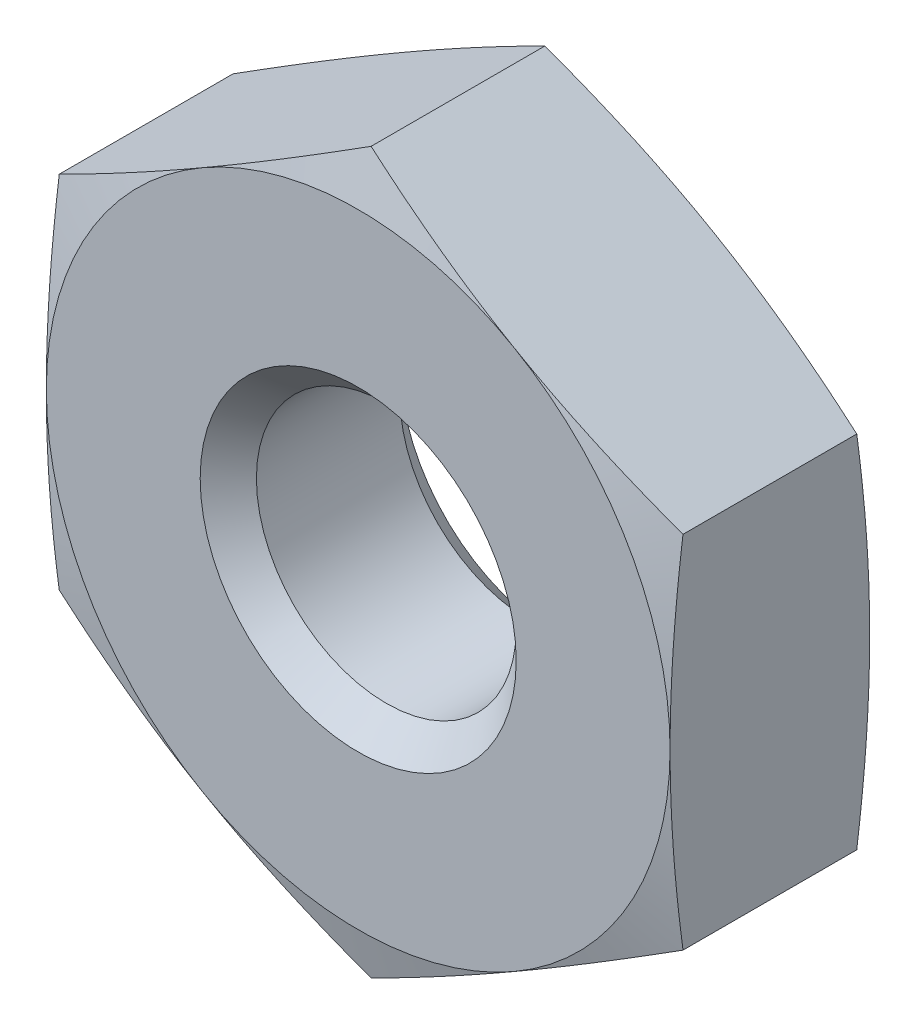
ISO-10303-21;
HEADER;
FILE_DESCRIPTION(('STEP AP214'),'2;1');
FILE_NAME('part.step','',(''),(''),'','','');
FILE_SCHEMA(('AUTOMOTIVE_DESIGN { 1 0 10303 214 1 1 1 1 }'));
ENDSEC;
DATA;
#1=APPLICATION_CONTEXT('core data for automotive mechanical design processes');
#2=APPLICATION_PROTOCOL_DEFINITION('international standard','automotive_design',2000,#1);
#3=PRODUCT_CONTEXT('',#1,'mechanical');
#4=PRODUCT('Part','Part','',(#3));
#5=PRODUCT_RELATED_PRODUCT_CATEGORY('part','',(#4));
#6=PRODUCT_DEFINITION_FORMATION('','',#4);
#7=PRODUCT_DEFINITION_CONTEXT('part definition',#1,'design');
#8=PRODUCT_DEFINITION('design','',#6,#7);
#9=PRODUCT_DEFINITION_SHAPE('','',#8);
#10=(LENGTH_UNIT() NAMED_UNIT(*) SI_UNIT(.MILLI.,.METRE.));
#11=(NAMED_UNIT(*) PLANE_ANGLE_UNIT() SI_UNIT($,.RADIAN.));
#12=(NAMED_UNIT(*) SI_UNIT($,.STERADIAN.) SOLID_ANGLE_UNIT());
#13=UNCERTAINTY_MEASURE_WITH_UNIT(LENGTH_MEASURE(1.E-05),#10,'distance_accuracy_value','');
#14=(GEOMETRIC_REPRESENTATION_CONTEXT(3) GLOBAL_UNCERTAINTY_ASSIGNED_CONTEXT((#13)) GLOBAL_UNIT_ASSIGNED_CONTEXT((#10,
#11,#12)) REPRESENTATION_CONTEXT('',''));
#15=CARTESIAN_POINT('',(0.,0.,0.));
#16=DIRECTION('',(0.,0.,1.));
#17=DIRECTION('',(1.,0.,0.));
#18=AXIS2_PLACEMENT_3D('',#15,#16,#17);
#19=CARTESIAN_POINT('',(0.,0.,0.));
#20=DIRECTION('',(0.,0.,-1.));
#21=DIRECTION('',(-1.,0.,0.));
#22=AXIS2_PLACEMENT_3D('',#19,#20,#21);
#23=PLANE('',#22);
#24=CARTESIAN_POINT('',(0.,0.,0.));
#25=DIRECTION('',(0.,0.,1.));
#26=DIRECTION('',(1.,0.,0.));
#27=AXIS2_PLACEMENT_3D('',#24,#25,#26);
#28=CIRCLE('',#27,2.41299999999001);
#29=CARTESIAN_POINT('',(2.41299999999001,0.,0.));
#30=VERTEX_POINT('',#29);
#31=EDGE_CURVE('E20',#30,#30,#28,.F.);
#32=ORIENTED_EDGE('',*,*,#31,.T.);
#33=EDGE_LOOP('',(#32));
#34=FACE_BOUND('',#33,.T.);
#35=CARTESIAN_POINT('',(0.,0.,0.));
#36=DIRECTION('',(0.,0.,-1.));
#37=DIRECTION('',(0.,1.,0.));
#38=AXIS2_PLACEMENT_3D('',#35,#36,#37);
#39=CIRCLE('',#38,4.7624999999698);
#40=CARTESIAN_POINT('',(-4.7624999999849,0.,-4.04533606351852E-12));
#41=VERTEX_POINT('',#40);
#42=CARTESIAN_POINT('',(-2.38124999999246,4.12444598551032,-4.04657973044043E-12));
#43=VERTEX_POINT('',#42);
#44=EDGE_CURVE('E130',#41,#43,#39,.T.);
#45=ORIENTED_EDGE('',*,*,#44,.F.);
#46=CARTESIAN_POINT('',(0.,0.,0.));
#47=DIRECTION('',(0.,0.,-1.));
#48=DIRECTION('',(0.,1.,0.));
#49=AXIS2_PLACEMENT_3D('',#46,#47,#48);
#50=CIRCLE('',#49,4.7624999999698);
#51=CARTESIAN_POINT('',(-2.38124999999245,-4.12444598551032,-4.04580046008107E-12));
#52=VERTEX_POINT('',#51);
#53=EDGE_CURVE('E128',#52,#41,#50,.T.);
#54=ORIENTED_EDGE('',*,*,#53,.F.);
#55=CARTESIAN_POINT('',(0.,0.,0.));
#56=DIRECTION('',(0.,0.,-1.));
#57=DIRECTION('',(0.,1.,0.));
#58=AXIS2_PLACEMENT_3D('',#55,#56,#57);
#59=CIRCLE('',#58,4.7624999999698);
#60=CARTESIAN_POINT('',(2.38124999999246,-4.12444598551031,-4.04656131367248E-12));
#61=VERTEX_POINT('',#60);
#62=EDGE_CURVE('E110',#61,#52,#59,.T.);
#63=ORIENTED_EDGE('',*,*,#62,.F.);
#64=CARTESIAN_POINT('',(0.,0.,0.));
#65=DIRECTION('',(0.,0.,-1.));
#66=DIRECTION('',(0.,1.,0.));
#67=AXIS2_PLACEMENT_3D('',#64,#65,#66);
#68=CIRCLE('',#67,4.7624999999698);
#69=CARTESIAN_POINT('',(4.7624999999849,0.,-4.04533558540813E-12));
#70=VERTEX_POINT('',#69);
#71=EDGE_CURVE('E103',#70,#61,#68,.T.);
#72=ORIENTED_EDGE('',*,*,#71,.F.);
#73=CARTESIAN_POINT('',(0.,0.,0.));
#74=DIRECTION('',(0.,0.,-1.));
#75=DIRECTION('',(0.,1.,0.));
#76=AXIS2_PLACEMENT_3D('',#73,#74,#75);
#77=CIRCLE('',#76,4.7624999999698);
#78=CARTESIAN_POINT('',(2.38124999999245,4.12444598551031,-4.04582372559714E-12));
#79=VERTEX_POINT('',#78);
#80=EDGE_CURVE('E425',#79,#70,#77,.T.);
#81=ORIENTED_EDGE('',*,*,#80,.F.);
#82=CARTESIAN_POINT('',(0.,0.,0.));
#83=DIRECTION('',(0.,0.,-1.));
#84=DIRECTION('',(0.,1.,0.));
#85=AXIS2_PLACEMENT_3D('',#82,#83,#84);
#86=CIRCLE('',#85,4.7624999999698);
#87=EDGE_CURVE('E135',#43,#79,#86,.T.);
#88=ORIENTED_EDGE('',*,*,#87,.F.);
#89=EDGE_LOOP('',(#45,#54,#63,#72,#81,#88));
#90=FACE_BOUND('',#89,.T.);
#91=ADVANCED_FACE('F17',(#34,#90),#23,.F.);
#92=CARTESIAN_POINT('',(0.,0.,0.));
#93=DIRECTION('',(0.,0.,1.));
#94=DIRECTION('',(1.,0.,0.));
#95=AXIS2_PLACEMENT_3D('',#92,#93,#94);
#96=CONICAL_SURFACE('',#95,2.41299999999001,0.785398163397448);
#97=ORIENTED_EDGE('',*,*,#31,.F.);
#98=EDGE_LOOP('',(#97));
#99=FACE_BOUND('',#98,.T.);
#100=CARTESIAN_POINT('',(0.,0.,-0.42926));
#101=DIRECTION('',(0.,0.,1.));
#102=DIRECTION('',(1.,0.,0.));
#103=AXIS2_PLACEMENT_3D('',#100,#101,#102);
#104=CIRCLE('',#103,1.98374);
#105=CARTESIAN_POINT('',(1.98374,0.,-0.42926));
#106=VERTEX_POINT('',#105);
#107=EDGE_CURVE('E125',#106,#106,#104,.F.);
#108=ORIENTED_EDGE('',*,*,#107,.T.);
#109=EDGE_LOOP('',(#108));
#110=FACE_BOUND('',#109,.T.);
#111=ADVANCED_FACE('F397',(#99,#110),#96,.F.);
#112=CARTESIAN_POINT('',(0.,0.,-0.198599086729701));
#113=DIRECTION('',(0.,0.,-1.));
#114=DIRECTION('',(0.,1.,0.));
#115=AXIS2_PLACEMENT_3D('',#112,#113,#114);
#116=CONICAL_SURFACE('',#115,5.50368188197581,1.30899693899372);
#117=ORIENTED_EDGE('',*,*,#62,.T.);
#118=CARTESIAN_POINT('',(-1.10100781708096E-12,-5.49926131403055,-0.197414599118673));
#119=CARTESIAN_POINT('',(-0.197405840343341,-5.38528899896936,-0.166865512952063));
#120=CARTESIAN_POINT('',(-0.395166009137093,-5.2711121122813,-0.139125457541238));
#121=CARTESIAN_POINT('',(-0.791077990089859,-5.04253222350282,-0.0904103419889045));
#122=CARTESIAN_POINT('',(-0.989229100594217,-4.92812962651291,-0.0694276203508561));
#123=CARTESIAN_POINT('',(-1.38610237940164,-4.69899473215927,-0.0352954826427711));
#124=CARTESIAN_POINT('',(-1.58482467133357,-4.58426236341839,-0.022147914684576));
#125=CARTESIAN_POINT('',(-1.88322873930389,-4.41197869444845,-0.0089070268822042));
#126=CARTESIAN_POINT('',(-1.98280832106101,-4.35448639611518,-0.00557342497592602));
#127=CARTESIAN_POINT('',(-2.18200766587997,-4.23947860076156,-0.00111726033218135));
#128=CARTESIAN_POINT('',(-2.28162743013149,-4.18196310305434,5.23126526352427E-06));
#129=CARTESIAN_POINT('',(-2.38125,-4.12444598552339,-8.09156365887653E-12));
#130=B_SPLINE_CURVE_WITH_KNOTS('',3,(#118,#119,#120,#121,#122,#123,#124,#125,#126,#127,#128,
#129),.UNSPECIFIED.,.F.,.F.,(4,2,2,2,2,4),(0.,0.68997774530214,1.37917041365534,
2.06852558060972,2.41360556986701,2.75869666150886),.UNSPECIFIED.);
#131=CARTESIAN_POINT('',(0.,-5.49926131403055,-0.197414599118673));
#132=VERTEX_POINT('',#131);
#133=EDGE_CURVE('E113',#132,#52,#130,.T.);
#134=ORIENTED_EDGE('',*,*,#133,.F.);
#135=CARTESIAN_POINT('',(2.38125000000001,-4.1244459855234,-8.09310346985567E-12));
#136=CARTESIAN_POINT('',(2.2816274301315,-4.18196310305434,5.23126526195123E-06));
#137=CARTESIAN_POINT('',(2.18200766587997,-4.23947860076157,-0.00111726033218282));
#138=CARTESIAN_POINT('',(1.98280832106102,-4.35448639611519,-0.00557342497592722));
#139=CARTESIAN_POINT('',(1.8832287393039,-4.41197869444845,-0.00890702688220526));
#140=CARTESIAN_POINT('',(1.58482467133357,-4.5842623634184,-0.0221479146845768));
#141=CARTESIAN_POINT('',(1.38610237940164,-4.69899473215928,-0.0352954826427721));
#142=CARTESIAN_POINT('',(0.989229100594223,-4.92812962651291,-0.0694276203508573));
#143=CARTESIAN_POINT('',(0.791077990089865,-5.04253222350282,-0.0904103419889056));
#144=CARTESIAN_POINT('',(0.395166009137099,-5.2711121122813,-0.139125457541239));
#145=CARTESIAN_POINT('',(0.197405840343347,-5.38528899896936,-0.166865512952064));
#146=CARTESIAN_POINT('',(1.10691644819718E-12,-5.49926131403056,-0.197414599118673));
#147=B_SPLINE_CURVE_WITH_KNOTS('',3,(#135,#136,#137,#138,#139,#140,#141,#142,#143,#144,#145,
#146),.UNSPECIFIED.,.F.,.F.,(4,2,2,2,2,4),(0.,0.345091091641847,0.690171080899136,
1.37952624785352,2.06871891620672,2.75869666150886),.UNSPECIFIED.);
#148=EDGE_CURVE('E115',#61,#132,#147,.T.);
#149=ORIENTED_EDGE('',*,*,#148,.F.);
#150=EDGE_LOOP('',(#117,#134,#149));
#151=FACE_BOUND('',#150,.T.);
#152=ADVANCED_FACE('F112',(#151),#116,.T.);
#153=CARTESIAN_POINT('',(0.,0.,-0.198599086729701));
#154=DIRECTION('',(0.,0.,-1.));
#155=DIRECTION('',(0.,1.,0.));
#156=AXIS2_PLACEMENT_3D('',#153,#154,#155);
#157=CONICAL_SURFACE('',#156,5.50368188197581,1.30899693899372);
#158=ORIENTED_EDGE('',*,*,#71,.T.);
#159=CARTESIAN_POINT('',(4.7624999999989,-2.74963065701624,-0.197414599118673));
#160=CARTESIAN_POINT('',(4.56509415965666,-2.86360297207744,-0.166865512952064));
#161=CARTESIAN_POINT('',(4.36733399086291,-2.97777985876549,-0.139125457541239));
#162=CARTESIAN_POINT('',(3.97142200991014,-3.20635974754397,-0.0904103419889058));
#163=CARTESIAN_POINT('',(3.77327089940579,-3.32076234453388,-0.0694276203508575));
#164=CARTESIAN_POINT('',(3.37639762059837,-3.54989723888751,-0.0352954826427724));
#165=CARTESIAN_POINT('',(3.17767532866644,-3.66462960762839,-0.0221479146845772));
#166=CARTESIAN_POINT('',(2.87927126069612,-3.83691327659834,-0.00890702688220558));
#167=CARTESIAN_POINT('',(2.77969167893899,-3.8944055749316,-0.00557342497592748));
#168=CARTESIAN_POINT('',(2.58049233412004,-4.00941337028522,-0.00111726033218291));
#169=CARTESIAN_POINT('',(2.48087256986852,-4.06692886799245,5.23126526196898E-06));
#170=CARTESIAN_POINT('',(2.38125000000001,-4.1244459855234,-8.09294901954408E-12));
#171=B_SPLINE_CURVE_WITH_KNOTS('',3,(#159,#160,#161,#162,#163,#164,#165,#166,#167,#168,#169,
#170),.UNSPECIFIED.,.F.,.F.,(4,2,2,2,2,4),(0.,0.689977745302137,1.37917041365533,
2.06852558060971,2.413605569867,2.75869666150884),.UNSPECIFIED.);
#172=CARTESIAN_POINT('',(4.76249999999945,-2.74963065701528,-0.197414599118673));
#173=VERTEX_POINT('',#172);
#174=EDGE_CURVE('E139',#173,#61,#171,.T.);
#175=ORIENTED_EDGE('',*,*,#174,.F.);
#176=CARTESIAN_POINT('',(4.7625,0.,-8.09065780609849E-12));
#177=CARTESIAN_POINT('',(4.7625,-0.115034235061893,5.23126526450705E-06));
#178=CARTESIAN_POINT('',(4.7625,-0.230065230476342,-0.00111726033218035));
#179=CARTESIAN_POINT('',(4.7625,-0.460080821183584,-0.00557342497592502));
#180=CARTESIAN_POINT('',(4.7625,-0.575065417850113,-0.00890702688220324));
#181=CARTESIAN_POINT('',(4.7625,-0.919632755790004,-0.0221479146845751));
#182=CARTESIAN_POINT('',(4.7625,-1.14909749327177,-0.0352954826427701));
#183=CARTESIAN_POINT('',(4.7625,-1.60736728197903,-0.0694276203508552));
#184=CARTESIAN_POINT('',(4.7625,-1.83617247595886,-0.0904103419889037));
#185=CARTESIAN_POINT('',(4.7625,-2.29333225351581,-0.139125457541237));
#186=CARTESIAN_POINT('',(4.7625,-2.52168602689193,-0.166865512952062));
#187=CARTESIAN_POINT('',(4.7625,-2.74963065701432,-0.197414599118672));
#188=B_SPLINE_CURVE_WITH_KNOTS('',3,(#176,#177,#178,#179,#180,#181,#182,#183,#184,#185,#186,
#187),.UNSPECIFIED.,.F.,.F.,(4,2,2,2,2,4),(0.,0.345091091641847,0.690171080899136,
1.37952624785352,2.06871891620672,2.75869666150886),.UNSPECIFIED.);
#189=EDGE_CURVE('E321',#70,#173,#188,.T.);
#190=ORIENTED_EDGE('',*,*,#189,.F.);
#191=EDGE_LOOP('',(#158,#175,#190));
#192=FACE_BOUND('',#191,.T.);
#193=ADVANCED_FACE('F389',(#192),#157,.T.);
#194=CARTESIAN_POINT('',(0.,0.,-0.198599086729701));
#195=DIRECTION('',(0.,0.,-1.));
#196=DIRECTION('',(0.,1.,0.));
#197=AXIS2_PLACEMENT_3D('',#194,#195,#196);
#198=CONICAL_SURFACE('',#197,5.50368188197581,1.30899693899372);
#199=ORIENTED_EDGE('',*,*,#80,.T.);
#200=CARTESIAN_POINT('',(4.7625,2.74963065701432,-0.197414599118672));
#201=CARTESIAN_POINT('',(4.7625,2.52168602689193,-0.166865512952062));
#202=CARTESIAN_POINT('',(4.7625,2.29333225351581,-0.139125457541237));
#203=CARTESIAN_POINT('',(4.7625,1.83617247595886,-0.0904103419889038));
#204=CARTESIAN_POINT('',(4.7625,1.60736728197903,-0.0694276203508553));
#205=CARTESIAN_POINT('',(4.7625,1.14909749327176,-0.0352954826427701));
#206=CARTESIAN_POINT('',(4.7625,0.919632755790003,-0.022147914684575));
#207=CARTESIAN_POINT('',(4.7625,0.575065417850113,-0.0089070268822032));
#208=CARTESIAN_POINT('',(4.7625,0.460080821183584,-0.005573424975925));
#209=CARTESIAN_POINT('',(4.7625,0.230065230476342,-0.00111726033218035));
#210=CARTESIAN_POINT('',(4.7625,0.115034235061893,5.23126526450129E-06));
#211=CARTESIAN_POINT('',(4.7625,0.,-8.09064406576194E-12));
#212=B_SPLINE_CURVE_WITH_KNOTS('',3,(#200,#201,#202,#203,#204,#205,#206,#207,#208,#209,#210,
#211),.UNSPECIFIED.,.F.,.F.,(4,2,2,2,2,4),(0.,0.68997774530214,1.37917041365534,
2.06852558060972,2.41360556986701,2.75869666150886),.UNSPECIFIED.);
#213=CARTESIAN_POINT('',(4.76249999999945,2.74963065701528,-0.197414599118672));
#214=VERTEX_POINT('',#213);
#215=EDGE_CURVE('E317',#214,#70,#212,.T.);
#216=ORIENTED_EDGE('',*,*,#215,.F.);
#217=CARTESIAN_POINT('',(2.38125,4.12444598552339,-8.09151740188484E-12));
#218=CARTESIAN_POINT('',(2.48087256986851,4.06692886799244,5.23126526366738E-06));
#219=CARTESIAN_POINT('',(2.58049233412004,4.00941337028522,-0.00111726033218119));
#220=CARTESIAN_POINT('',(2.77969167893899,3.8944055749316,-0.0055734249759259));
#221=CARTESIAN_POINT('',(2.87927126069611,3.83691327659834,-0.00890702688220413));
#222=CARTESIAN_POINT('',(3.17767532866643,3.66462960762839,-0.022147914684576));
#223=CARTESIAN_POINT('',(3.37639762059837,3.54989723888751,-0.0352954826427711));
#224=CARTESIAN_POINT('',(3.77327089940578,3.32076234453388,-0.0694276203508561));
#225=CARTESIAN_POINT('',(3.97142200991014,3.20635974754397,-0.0904103419889044));
#226=CARTESIAN_POINT('',(4.3673339908629,2.97777985876549,-0.139125457541237));
#227=CARTESIAN_POINT('',(4.56509415965665,2.86360297207743,-0.166865512952062));
#228=CARTESIAN_POINT('',(4.76249999999889,2.74963065701623,-0.197414599118672));
#229=B_SPLINE_CURVE_WITH_KNOTS('',3,(#217,#218,#219,#220,#221,#222,#223,#224,#225,#226,#227,
#228),.UNSPECIFIED.,.F.,.F.,(4,2,2,2,2,4),(0.,0.345091091641846,0.690171080899133,
1.37952624785351,2.06871891620671,2.75869666150884),.UNSPECIFIED.);
#230=EDGE_CURVE('E325',#79,#214,#229,.T.);
#231=ORIENTED_EDGE('',*,*,#230,.F.);
#232=EDGE_LOOP('',(#199,#216,#231));
#233=FACE_BOUND('',#232,.T.);
#234=ADVANCED_FACE('F392',(#233),#198,.T.);
#235=CARTESIAN_POINT('',(0.,0.,-0.198599086729701));
#236=DIRECTION('',(0.,0.,-1.));
#237=DIRECTION('',(0.,1.,0.));
#238=AXIS2_PLACEMENT_3D('',#235,#236,#237);
#239=CONICAL_SURFACE('',#238,5.50368188197581,1.30899693899372);
#240=CARTESIAN_POINT('',(-2.38125000000001,4.1244459855234,-8.09315141584367E-12));
#241=CARTESIAN_POINT('',(-2.2816274301315,4.18196310305434,5.23126526194159E-06));
#242=CARTESIAN_POINT('',(-2.18200766587997,4.23947860076157,-0.00111726033218282));
#243=CARTESIAN_POINT('',(-1.98280832106102,4.35448639611519,-0.00557342497592722));
#244=CARTESIAN_POINT('',(-1.8832287393039,4.41197869444845,-0.00890702688220527));
#245=CARTESIAN_POINT('',(-1.58482467133357,4.5842623634184,-0.0221479146845769));
#246=CARTESIAN_POINT('',(-1.38610237940164,4.69899473215928,-0.0352954826427721));
#247=CARTESIAN_POINT('',(-0.989229100594223,4.92812962651291,-0.0694276203508573));
#248=CARTESIAN_POINT('',(-0.791077990089865,5.04253222350282,-0.0904103419889056));
#249=CARTESIAN_POINT('',(-0.395166009137099,5.2711121122813,-0.139125457541239));
#250=CARTESIAN_POINT('',(-0.197405840343347,5.38528899896936,-0.166865512952064));
#251=CARTESIAN_POINT('',(-1.10691644819718E-12,5.49926131403056,-0.197414599118673));
#252=B_SPLINE_CURVE_WITH_KNOTS('',3,(#240,#241,#242,#243,#244,#245,#246,#247,#248,#249,#250,
#251),.UNSPECIFIED.,.F.,.F.,(4,2,2,2,2,4),(0.,0.345091091641847,0.690171080899136,
1.37952624785352,2.06871891620672,2.75869666150886),.UNSPECIFIED.);
#253=CARTESIAN_POINT('',(0.,5.49926131403055,-0.197414599118673));
#254=VERTEX_POINT('',#253);
#255=EDGE_CURVE('E183',#43,#254,#252,.T.);
#256=ORIENTED_EDGE('',*,*,#255,.F.);
#257=ORIENTED_EDGE('',*,*,#87,.T.);
#258=CARTESIAN_POINT('',(1.1017532977768E-12,5.49926131403055,-0.197414599118673));
#259=CARTESIAN_POINT('',(0.197405840343342,5.38528899896935,-0.166865512952063));
#260=CARTESIAN_POINT('',(0.395166009137094,5.2711121122813,-0.139125457541237));
#261=CARTESIAN_POINT('',(0.79107799008986,5.04253222350282,-0.0904103419889044));
#262=CARTESIAN_POINT('',(0.989229100594218,4.92812962651291,-0.0694276203508561));
#263=CARTESIAN_POINT('',(1.38610237940164,4.69899473215927,-0.035295482642771));
#264=CARTESIAN_POINT('',(1.58482467133357,4.58426236341839,-0.0221479146845757));
#265=CARTESIAN_POINT('',(1.88322873930389,4.41197869444845,-0.00890702688220403));
#266=CARTESIAN_POINT('',(1.98280832106101,4.35448639611518,-0.00557342497592598));
#267=CARTESIAN_POINT('',(2.18200766587997,4.23947860076156,-0.0011172603321815));
#268=CARTESIAN_POINT('',(2.28162743013149,4.18196310305434,5.23126526332879E-06));
#269=CARTESIAN_POINT('',(2.38125,4.12444598552339,-8.09160046136907E-12));
#270=B_SPLINE_CURVE_WITH_KNOTS('',3,(#258,#259,#260,#261,#262,#263,#264,#265,#266,#267,#268,
#269),.UNSPECIFIED.,.F.,.F.,(4,2,2,2,2,4),(0.,0.68997774530214,1.37917041365534,
2.06852558060972,2.41360556986701,2.75869666150886),.UNSPECIFIED.);
#271=EDGE_CURVE('E320',#254,#79,#270,.T.);
#272=ORIENTED_EDGE('',*,*,#271,.F.);
#273=EDGE_LOOP('',(#256,#257,#272));
#274=FACE_BOUND('',#273,.T.);
#275=ADVANCED_FACE('F165',(#274),#239,.T.);
#276=CARTESIAN_POINT('',(0.,0.,-0.198599086729701));
#277=DIRECTION('',(0.,0.,-1.));
#278=DIRECTION('',(0.,1.,0.));
#279=AXIS2_PLACEMENT_3D('',#276,#277,#278);
#280=CONICAL_SURFACE('',#279,5.50368188197581,1.30899693899372);
#281=CARTESIAN_POINT('',(-2.38125,-4.12444598552339,-8.09163584341431E-12));
#282=CARTESIAN_POINT('',(-2.48087256986851,-4.06692886799244,5.23126526345237E-06));
#283=CARTESIAN_POINT('',(-2.58049233412004,-4.00941337028522,-0.00111726033218138));
#284=CARTESIAN_POINT('',(-2.77969167893899,-3.8944055749316,-0.00557342497592596));
#285=CARTESIAN_POINT('',(-2.87927126069611,-3.83691327659834,-0.0089070268822041));
#286=CARTESIAN_POINT('',(-3.17767532866643,-3.66462960762839,-0.0221479146845759));
#287=CARTESIAN_POINT('',(-3.37639762059837,-3.54989723888751,-0.0352954826427711));
#288=CARTESIAN_POINT('',(-3.77327089940578,-3.32076234453388,-0.0694276203508561));
#289=CARTESIAN_POINT('',(-3.97142200991014,-3.20635974754397,-0.0904103419889043));
#290=CARTESIAN_POINT('',(-4.3673339908629,-2.97777985876549,-0.139125457541237));
#291=CARTESIAN_POINT('',(-4.56509415965665,-2.86360297207743,-0.166865512952062));
#292=CARTESIAN_POINT('',(-4.76249999999889,-2.74963065701623,-0.197414599118672));
#293=B_SPLINE_CURVE_WITH_KNOTS('',3,(#281,#282,#283,#284,#285,#286,#287,#288,#289,#290,#291,
#292),.UNSPECIFIED.,.F.,.F.,(4,2,2,2,2,4),(0.,0.345091091641846,0.690171080899134,
1.37952624785351,2.06871891620671,2.75869666150885),.UNSPECIFIED.);
#294=CARTESIAN_POINT('',(-4.76249999999945,-2.74963065701592,-0.197414599118757));
#295=VERTEX_POINT('',#294);
#296=EDGE_CURVE('E122',#52,#295,#293,.T.);
#297=ORIENTED_EDGE('',*,*,#296,.F.);
#298=ORIENTED_EDGE('',*,*,#53,.T.);
#299=CARTESIAN_POINT('',(-4.7625,-2.74963065701432,-0.197414599118672));
#300=CARTESIAN_POINT('',(-4.7625,-2.52168602689193,-0.166865512952062));
#301=CARTESIAN_POINT('',(-4.7625,-2.29333225351581,-0.139125457541237));
#302=CARTESIAN_POINT('',(-4.7625,-1.83617247595886,-0.0904103419889037));
#303=CARTESIAN_POINT('',(-4.7625,-1.60736728197903,-0.0694276203508553));
#304=CARTESIAN_POINT('',(-4.7625,-1.14909749327177,-0.0352954826427701));
#305=CARTESIAN_POINT('',(-4.7625,-0.919632755790004,-0.022147914684575));
#306=CARTESIAN_POINT('',(-4.7625,-0.575065417850113,-0.00890702688220322));
#307=CARTESIAN_POINT('',(-4.7625,-0.460080821183584,-0.00557342497592502));
#308=CARTESIAN_POINT('',(-4.7625,-0.230065230476342,-0.00111726033218037));
#309=CARTESIAN_POINT('',(-4.7625,-0.115034235061893,5.23126526449092E-06));
#310=CARTESIAN_POINT('',(-4.7625,0.,-8.09061696076563E-12));
#311=B_SPLINE_CURVE_WITH_KNOTS('',3,(#299,#300,#301,#302,#303,#304,#305,#306,#307,#308,#309,
#310),.UNSPECIFIED.,.F.,.F.,(4,2,2,2,2,4),(0.,0.68997774530214,1.37917041365534,
2.06852558060972,2.41360556986701,2.75869666150886),.UNSPECIFIED.);
#312=EDGE_CURVE('E138',#295,#41,#311,.T.);
#313=ORIENTED_EDGE('',*,*,#312,.F.);
#314=EDGE_LOOP('',(#297,#298,#313));
#315=FACE_BOUND('',#314,.T.);
#316=ADVANCED_FACE('F137',(#315),#280,.T.);
#317=CARTESIAN_POINT('',(0.,0.,-0.198599086729701));
#318=DIRECTION('',(0.,0.,-1.));
#319=DIRECTION('',(0.,1.,0.));
#320=AXIS2_PLACEMENT_3D('',#317,#318,#319);
#321=CONICAL_SURFACE('',#320,5.50368188197581,1.30899693899372);
#322=ORIENTED_EDGE('',*,*,#44,.T.);
#323=CARTESIAN_POINT('',(-4.7624999999989,2.74963065701624,-0.197414599118673));
#324=CARTESIAN_POINT('',(-4.56509415965666,2.86360297207744,-0.166865512952064));
#325=CARTESIAN_POINT('',(-4.36733399086291,2.97777985876549,-0.139125457541239));
#326=CARTESIAN_POINT('',(-3.97142200991014,3.20635974754397,-0.0904103419889058));
#327=CARTESIAN_POINT('',(-3.77327089940579,3.32076234453388,-0.0694276203508575));
#328=CARTESIAN_POINT('',(-3.37639762059837,3.54989723888751,-0.0352954826427724));
#329=CARTESIAN_POINT('',(-3.17767532866644,3.66462960762839,-0.0221479146845773));
#330=CARTESIAN_POINT('',(-2.87927126069612,3.83691327659834,-0.00890702688220558));
#331=CARTESIAN_POINT('',(-2.77969167893899,3.8944055749316,-0.00557342497592747));
#332=CARTESIAN_POINT('',(-2.58049233412004,4.00941337028522,-0.00111726033218289));
#333=CARTESIAN_POINT('',(-2.48087256986852,4.06692886799245,5.23126526199242E-06));
#334=CARTESIAN_POINT('',(-2.38125000000001,4.1244459855234,-8.09294806332329E-12));
#335=B_SPLINE_CURVE_WITH_KNOTS('',3,(#323,#324,#325,#326,#327,#328,#329,#330,#331,#332,#333,
#334),.UNSPECIFIED.,.F.,.F.,(4,2,2,2,2,4),(0.,0.689977745302137,1.37917041365533,
2.06852558060971,2.413605569867,2.75869666150884),.UNSPECIFIED.);
#336=CARTESIAN_POINT('',(-4.76249999999945,2.74963065701528,-0.197414599118673));
#337=VERTEX_POINT('',#336);
#338=EDGE_CURVE('E324',#337,#43,#335,.T.);
#339=ORIENTED_EDGE('',*,*,#338,.F.);
#340=CARTESIAN_POINT('',(-4.7625,0.,-8.09065780609849E-12));
#341=CARTESIAN_POINT('',(-4.7625,0.115034235061893,5.23126526450624E-06));
#342=CARTESIAN_POINT('',(-4.7625,0.230065230476342,-0.00111726033218034));
#343=CARTESIAN_POINT('',(-4.7625,0.460080821183584,-0.00557342497592502));
#344=CARTESIAN_POINT('',(-4.7625,0.575065417850113,-0.00890702688220323));
#345=CARTESIAN_POINT('',(-4.7625,0.919632755790004,-0.0221479146845751));
#346=CARTESIAN_POINT('',(-4.7625,1.14909749327177,-0.0352954826427701));
#347=CARTESIAN_POINT('',(-4.7625,1.60736728197903,-0.0694276203508552));
#348=CARTESIAN_POINT('',(-4.7625,1.83617247595886,-0.0904103419889037));
#349=CARTESIAN_POINT('',(-4.7625,2.29333225351581,-0.139125457541237));
#350=CARTESIAN_POINT('',(-4.7625,2.52168602689193,-0.166865512952062));
#351=CARTESIAN_POINT('',(-4.7625,2.74963065701432,-0.197414599118672));
#352=B_SPLINE_CURVE_WITH_KNOTS('',3,(#340,#341,#342,#343,#344,#345,#346,#347,#348,#349,#350,
#351),.UNSPECIFIED.,.F.,.F.,(4,2,2,2,2,4),(0.,0.345091091641847,0.690171080899136,
1.37952624785352,2.06871891620672,2.75869666150886),.UNSPECIFIED.);
#353=EDGE_CURVE('E177',#41,#337,#352,.T.);
#354=ORIENTED_EDGE('',*,*,#353,.F.);
#355=EDGE_LOOP('',(#322,#339,#354));
#356=FACE_BOUND('',#355,.T.);
#357=ADVANCED_FACE('F164',(#356),#321,.T.);
#358=CARTESIAN_POINT('',(0.,0.,-3.048));
#359=DIRECTION('',(0.,0.,1.));
#360=DIRECTION('',(1.,0.,0.));
#361=AXIS2_PLACEMENT_3D('',#358,#359,#360);
#362=CYLINDRICAL_SURFACE('',#361,1.98374);
#363=ORIENTED_EDGE('',*,*,#107,.F.);
#364=EDGE_LOOP('',(#363));
#365=FACE_BOUND('',#364,.T.);
#366=CARTESIAN_POINT('',(0.,0.,-2.61874000000262));
#367=DIRECTION('',(0.,0.,-1.));
#368=DIRECTION('',(-1.,0.,0.));
#369=AXIS2_PLACEMENT_3D('',#366,#367,#368);
#370=CIRCLE('',#369,1.98373999995738);
#371=CARTESIAN_POINT('',(-1.98373999995738,0.,-2.61874000000262));
#372=VERTEX_POINT('',#371);
#373=EDGE_CURVE('E216',#372,#372,#370,.T.);
#374=ORIENTED_EDGE('',*,*,#373,.T.);
#375=EDGE_LOOP('',(#374));
#376=FACE_BOUND('',#375,.T.);
#377=ADVANCED_FACE('F336',(#365,#376),#362,.F.);
#378=CARTESIAN_POINT('',(-4.7625,-2.7496306570156,-3.048));
#379=DIRECTION('',(-0.5,-0.866025403784439,0.));
#380=DIRECTION('',(0.866025403784439,-0.5,0.));
#381=AXIS2_PLACEMENT_3D('',#378,#379,#380);
#382=PLANE('',#381);
#383=CARTESIAN_POINT('',(3.96377688690681E-08,-5.49926133691606,-2.85058539480885));
#384=CARTESIAN_POINT('',(-0.197405803966096,-5.38528901997177,-2.88113448186259));
#385=CARTESIAN_POINT('',(-0.39516597603361,-5.2711121313936,-2.90887453810665));
#386=CARTESIAN_POINT('',(-0.791077963548569,-5.04253223882644,-2.95758965515473));
#387=CARTESIAN_POINT('',(-0.989229077341312,-4.92812963993798,-2.97857237745567));
#388=CARTESIAN_POINT('',(-1.38610236275268,-4.69899474177155,-3.01270451626038));
#389=CARTESIAN_POINT('',(-1.58482465800018,-4.58426237111643,-3.02585208465216));
#390=CARTESIAN_POINT('',(-1.88322873095886,-4.41197869926645,-3.03909297289422));
#391=CARTESIAN_POINT('',(-1.98280831438369,-4.35448639997034,-3.04242657491196));
#392=CARTESIAN_POINT('',(-2.18200766254018,-4.23947860268979,-3.04688273970508));
#393=CARTESIAN_POINT('',(-2.28162742846153,-4.18196310401849,-3.04800523134043));
#394=CARTESIAN_POINT('',(-2.38125000000001,-4.12444598552339,-3.04800000006672));
#395=B_SPLINE_CURVE_WITH_KNOTS('',3,(#383,#384,#385,#386,#387,#388,#389,#390,#391,#392,#393,
#394),.UNSPECIFIED.,.F.,.F.,(4,2,2,2,2,4),(0.,0.689977756856798,1.37917043673169,
2.06852561521938,2.4136056102601,2.7586967076863),.UNSPECIFIED.);
#396=CARTESIAN_POINT('',(4.18420839586607E-08,-5.49926128987366,-2.85058540741382));
#397=VERTEX_POINT('',#396);
#398=CARTESIAN_POINT('',(-2.38124999999246,-4.12444598551031,-3.04800000007077));
#399=VERTEX_POINT('',#398);
#400=EDGE_CURVE('E237',#397,#399,#395,.T.);
#401=ORIENTED_EDGE('',*,*,#400,.F.);
#402=DIRECTION('',(0.,0.,1.));
#403=VECTOR('',#402,1.);
#404=CARTESIAN_POINT('',(0.,-5.49926131403119,-3.048));
#405=LINE('',#404,#403);
#406=EDGE_CURVE('E124',#132,#397,#405,.F.);
#407=ORIENTED_EDGE('',*,*,#406,.F.);
#408=ORIENTED_EDGE('',*,*,#133,.T.);
#409=ORIENTED_EDGE('',*,*,#296,.T.);
#410=DIRECTION('',(0.,0.,1.));
#411=VECTOR('',#410,1.);
#412=CARTESIAN_POINT('',(-4.7625,-2.7496306570156,-3.048));
#413=LINE('',#412,#411);
#414=CARTESIAN_POINT('',(-4.76250001982401,-2.7496306455702,-2.85058539787405));
#415=VERTEX_POINT('',#414);
#416=EDGE_CURVE('E287',#415,#295,#413,.T.);
#417=ORIENTED_EDGE('',*,*,#416,.F.);
#418=CARTESIAN_POINT('',(-2.38125000000001,-4.12444598552339,-3.04800000006672));
#419=CARTESIAN_POINT('',(-2.48087257153892,-4.06692886702804,-3.04800523134043));
#420=CARTESIAN_POINT('',(-2.5804923374607,-4.00941336835649,-3.04688273970507));
#421=CARTESIAN_POINT('',(-2.77969168561804,-3.89440557107545,-3.04242657491191));
#422=CARTESIAN_POINT('',(-2.8792712690433,-3.83691327177908,-3.03909297289415));
#423=CARTESIAN_POINT('',(-3.17767534200327,-3.66462959992836,-3.02585208465197));
#424=CARTESIAN_POINT('',(-3.37639763725163,-3.54989722927274,-3.01270451626008));
#425=CARTESIAN_POINT('',(-3.7732709226647,-3.32076233110533,-2.97857237745508));
#426=CARTESIAN_POINT('',(-3.9714220364583,-3.20635973221638,-2.95758965515397));
#427=CARTESIAN_POINT('',(-4.36733402397495,-2.97777983964824,-2.90887453810551));
#428=CARTESIAN_POINT('',(-4.56509419604331,-2.86360295106959,-2.88113448186123));
#429=CARTESIAN_POINT('',(-4.76250003964801,-2.7496306341248,-2.85058539480726));
#430=B_SPLINE_CURVE_WITH_KNOTS('',3,(#418,#419,#420,#421,#422,#423,#424,#425,#426,#427,#428,
#429),.UNSPECIFIED.,.F.,.F.,(4,2,2,2,2,4),(0.,0.345091097427699,0.690171092469904,
1.37952627096058,2.06871895083844,2.75869670769822),.UNSPECIFIED.);
#431=EDGE_CURVE('E215',#399,#415,#430,.T.);
#432=ORIENTED_EDGE('',*,*,#431,.F.);
#433=EDGE_LOOP('',(#401,#407,#408,#409,#417,#432));
#434=FACE_BOUND('',#433,.T.);
#435=ADVANCED_FACE('F120',(#434),#382,.T.);
#436=CARTESIAN_POINT('',(0.,-5.49926131403119,-3.048));
#437=DIRECTION('',(0.5,-0.866025403784439,0.));
#438=DIRECTION('',(0.866025403784439,0.5,0.));
#439=AXIS2_PLACEMENT_3D('',#436,#437,#438);
#440=PLANE('',#439);
#441=CARTESIAN_POINT('',(4.76250003963458,-2.74963063413257,-2.85058539480934));
#442=CARTESIAN_POINT('',(4.56509419603097,-2.86360295107671,-2.88113448186301));
#443=CARTESIAN_POINT('',(4.36733402396372,-2.97777983965473,-2.908874538107));
#444=CARTESIAN_POINT('',(3.9714220364493,-3.20635973222158,-2.95758965515496));
#445=CARTESIAN_POINT('',(3.77327092265682,-3.32076233110989,-2.97857237745585));
#446=CARTESIAN_POINT('',(3.37639763724599,-3.54989722927601,-3.01270451626047));
#447=CARTESIAN_POINT('',(3.17767534199875,-3.66462959993098,-3.02585208465222));
#448=CARTESIAN_POINT('',(2.87927126904048,-3.83691327178072,-3.03909297289425));
#449=CARTESIAN_POINT('',(2.77969168561578,-3.89440557107676,-3.04242657491197));
#450=CARTESIAN_POINT('',(2.58049233745956,-4.00941336835715,-3.04688273970508));
#451=CARTESIAN_POINT('',(2.48087257153835,-4.06692886702837,-3.04800523134042));
#452=CARTESIAN_POINT('',(2.38125000000001,-4.1244459855234,-3.04800000006672));
#453=B_SPLINE_CURVE_WITH_KNOTS('',3,(#441,#442,#443,#444,#445,#446,#447,#448,#449,#450,#451,
#452),.UNSPECIFIED.,.F.,.F.,(4,2,2,2,2,4),(0.,0.689977756855864,1.37917043672982,
2.06852561521659,2.41360561025683,2.75869670768257),.UNSPECIFIED.);
#454=CARTESIAN_POINT('',(4.7625,-2.74963060870237,-2.85058540741358));
#455=VERTEX_POINT('',#454);
#456=CARTESIAN_POINT('',(2.38124999999245,-4.12444598551032,-3.04800000007077));
#457=VERTEX_POINT('',#456);
#458=EDGE_CURVE('E262',#455,#457,#453,.T.);
#459=ORIENTED_EDGE('',*,*,#458,.F.);
#460=DIRECTION('',(0.,0.,-1.));
#461=VECTOR('',#460,1.);
#462=CARTESIAN_POINT('',(4.7625,-2.7496306570156,-3.048));
#463=LINE('',#462,#461);
#464=EDGE_CURVE('E318',#173,#455,#463,.T.);
#465=ORIENTED_EDGE('',*,*,#464,.F.);
#466=ORIENTED_EDGE('',*,*,#174,.T.);
#467=ORIENTED_EDGE('',*,*,#148,.T.);
#468=ORIENTED_EDGE('',*,*,#406,.T.);
#469=CARTESIAN_POINT('',(2.38125000000001,-4.1244459855234,-3.04800000006672));
#470=CARTESIAN_POINT('',(2.28162743365684,-4.18196310101898,-3.04800523133935));
#471=CARTESIAN_POINT('',(2.18200767293035,-4.23947859669103,-3.04688273982166));
#472=CARTESIAN_POINT('',(1.98280833515701,-4.35448638797686,-3.04242657549217));
#473=CARTESIAN_POINT('',(1.88322875692048,-4.41197868427751,-3.03909297382039));
#474=CARTESIAN_POINT('',(1.5848246994809,-4.58426234716753,-3.02585208694308));
#475=CARTESIAN_POINT('',(1.38610241454846,-4.69899471186725,-3.01270451989707));
#476=CARTESIAN_POINT('',(0.989229149682876,-4.92812959817156,-2.97857238449593));
#477=CARTESIAN_POINT('',(0.791078046120885,-5.0425321911533,-2.95758966425233));
#478=CARTESIAN_POINT('',(0.395166079022261,-5.27111207193308,-2.90887455184612));
#479=CARTESIAN_POINT('',(0.197405917140188,-5.38528895463068,-2.88113449818779));
#480=CARTESIAN_POINT('',(8.36841674310951E-08,-5.49926126571612,-2.85058541388682));
#481=B_SPLINE_CURVE_WITH_KNOTS('',3,(#469,#470,#471,#472,#473,#474,#475,#476,#477,#478,#479,
#480),.UNSPECIFIED.,.F.,.F.,(4,2,2,2,2,4),(0.,0.345091079430938,0.690171056479286,
1.3795261990862,2.06871884311639,2.75869656402629),.UNSPECIFIED.);
#482=EDGE_CURVE('E242',#457,#397,#481,.T.);
#483=ORIENTED_EDGE('',*,*,#482,.F.);
#484=EDGE_LOOP('',(#459,#465,#466,#467,#468,#483));
#485=FACE_BOUND('',#484,.T.);
#486=ADVANCED_FACE('F247',(#485),#440,.T.);
#487=CARTESIAN_POINT('',(4.7625,-2.7496306570156,-3.048));
#488=DIRECTION('',(1.,0.,0.));
#489=DIRECTION('',(0.,0.,-1.));
#490=AXIS2_PLACEMENT_3D('',#487,#488,#489);
#491=PLANE('',#490);
#492=CARTESIAN_POINT('',(4.7625,2.74963070278343,-2.85058539480911));
#493=CARTESIAN_POINT('',(4.7625,2.52168606889499,-2.88113448186281));
#494=CARTESIAN_POINT('',(4.7625,2.29333229173882,-2.90887453810684));
#495=CARTESIAN_POINT('',(4.7625,1.83617250660481,-2.95758965515485));
#496=CARTESIAN_POINT('',(4.7625,1.60736730882805,-2.97857237745576));
#497=CARTESIAN_POINT('',(4.7625,1.14909751249552,-3.01270451626043));
#498=CARTESIAN_POINT('',(4.7625,0.919632771185427,-3.02585208465219));
#499=CARTESIAN_POINT('',(4.7625,0.575065427485721,-3.03909297289424));
#500=CARTESIAN_POINT('',(4.7625,0.46008082889357,-3.04242657491197));
#501=CARTESIAN_POINT('',(4.7625,0.230065234332641,-3.04688273970508));
#502=CARTESIAN_POINT('',(4.7625,0.115034236990127,-3.04800523134043));
#503=CARTESIAN_POINT('',(4.7625,0.,-3.04800000006673));
#504=B_SPLINE_CURVE_WITH_KNOTS('',3,(#492,#493,#494,#495,#496,#497,#498,#499,#500,#501,#502,
#503),.UNSPECIFIED.,.F.,.F.,(4,2,2,2,2,4),(0.,0.689977756856311,1.37917043673072,
2.06852561521793,2.4136056102584,2.75869670768436),.UNSPECIFIED.);
#505=CARTESIAN_POINT('',(4.76249995815875,2.74963068117265,-2.8505854074137));
#506=VERTEX_POINT('',#505);
#507=CARTESIAN_POINT('',(4.7624999999849,0.,-3.04800000007077));
#508=VERTEX_POINT('',#507);
#509=EDGE_CURVE('E434',#506,#508,#504,.T.);
#510=ORIENTED_EDGE('',*,*,#509,.F.);
#511=DIRECTION('',(0.,0.,1.));
#512=VECTOR('',#511,1.);
#513=CARTESIAN_POINT('',(4.7625,2.7496306570156,-3.048));
#514=LINE('',#513,#512);
#515=EDGE_CURVE('E322',#214,#506,#514,.F.);
#516=ORIENTED_EDGE('',*,*,#515,.F.);
#517=ORIENTED_EDGE('',*,*,#215,.T.);
#518=ORIENTED_EDGE('',*,*,#189,.T.);
#519=ORIENTED_EDGE('',*,*,#464,.T.);
#520=CARTESIAN_POINT('',(4.7625,0.,-3.04800000006673));
#521=CARTESIAN_POINT('',(4.7625,-0.115034230991335,-3.04800523133935));
#522=CARTESIAN_POINT('',(4.7625,-0.23006522233558,-3.04688273982166));
#523=CARTESIAN_POINT('',(4.7625,-0.460080804907549,-3.04242657549216));
#524=CARTESIAN_POINT('',(4.7625,-0.57506539750901,-3.03909297382037));
#525=CARTESIAN_POINT('',(4.7625,-0.919632723289508,-3.02585208694302));
#526=CARTESIAN_POINT('',(4.7625,-1.14909745268926,-3.01270451989698));
#527=CARTESIAN_POINT('',(4.7625,-1.6073672252985,-2.97857238449575));
#528=CARTESIAN_POINT('',(4.7625,-1.83617241126228,-2.95758966425209));
#529=CARTESIAN_POINT('',(4.7625,-2.29333217282246,-2.90887455184577));
#530=CARTESIAN_POINT('',(4.7625,-2.52168593821796,-2.88113449818737));
#531=CARTESIAN_POINT('',(4.7625,-2.74963056038914,-2.85058541388632));
#532=B_SPLINE_CURVE_WITH_KNOTS('',3,(#520,#521,#522,#523,#524,#525,#526,#527,#528,#529,#530,
#531),.UNSPECIFIED.,.F.,.F.,(4,2,2,2,2,4),(0.,0.345091079431404,0.690171056480219,
1.37952619908807,2.06871884311918,2.75869656403001),.UNSPECIFIED.);
#533=EDGE_CURVE('E268',#508,#455,#532,.T.);
#534=ORIENTED_EDGE('',*,*,#533,.F.);
#535=EDGE_LOOP('',(#510,#516,#517,#518,#519,#534));
#536=FACE_BOUND('',#535,.T.);
#537=ADVANCED_FACE('F251',(#536),#491,.T.);
#538=CARTESIAN_POINT('',(4.7625,2.7496306570156,-3.048));
#539=DIRECTION('',(0.5,0.866025403784439,0.));
#540=DIRECTION('',(-0.866025403784439,0.5,0.));
#541=AXIS2_PLACEMENT_3D('',#538,#539,#540);
#542=PLANE('',#541);
#543=CARTESIAN_POINT('',(-3.96365757526977E-08,5.49926133691538,-2.85058539480903));
#544=CARTESIAN_POINT('',(0.197405803967191,5.38528901997114,-2.88113448186275));
#545=CARTESIAN_POINT('',(0.395165976034607,5.27111213139303,-2.90887453810678));
#546=CARTESIAN_POINT('',(0.791077963549368,5.04253223882598,-2.95758965515481));
#547=CARTESIAN_POINT('',(0.989229077342012,4.92812963993757,-2.97857237745573));
#548=CARTESIAN_POINT('',(1.38610236275318,4.69899474177127,-3.01270451626041));
#549=CARTESIAN_POINT('',(1.58482465800058,4.5842623711162,-3.02585208465218));
#550=CARTESIAN_POINT('',(1.88322873095911,4.41197869926631,-3.03909297289423));
#551=CARTESIAN_POINT('',(1.98280831438389,4.35448639997022,-3.04242657491197));
#552=CARTESIAN_POINT('',(2.18200766254028,4.23947860268973,-3.04688273970508));
#553=CARTESIAN_POINT('',(2.28162742846157,4.18196310401847,-3.04800523134043));
#554=CARTESIAN_POINT('',(2.38125,4.12444598552339,-3.04800000006673));
#555=B_SPLINE_CURVE_WITH_KNOTS('',3,(#543,#544,#545,#546,#547,#548,#549,#550,#551,#552,#553,
#554),.UNSPECIFIED.,.F.,.F.,(4,2,2,2,2,4),(0.,0.68997775685645,1.37917043673099,
2.06852561521834,2.41360561025888,2.75869670768491),.UNSPECIFIED.);
#556=CARTESIAN_POINT('',(-4.18414874015747E-08,5.499261289874,-2.85058540741373));
#557=VERTEX_POINT('',#556);
#558=CARTESIAN_POINT('',(2.38124999999245,4.12444598551031,-3.04800000007077));
#559=VERTEX_POINT('',#558);
#560=EDGE_CURVE('E357',#557,#559,#555,.T.);
#561=ORIENTED_EDGE('',*,*,#560,.F.);
#562=DIRECTION('',(0.,0.,1.));
#563=VECTOR('',#562,1.);
#564=CARTESIAN_POINT('',(0.,5.49926131403119,-3.048));
#565=LINE('',#564,#563);
#566=EDGE_CURVE('E178',#254,#557,#565,.F.);
#567=ORIENTED_EDGE('',*,*,#566,.F.);
#568=ORIENTED_EDGE('',*,*,#271,.T.);
#569=ORIENTED_EDGE('',*,*,#230,.T.);
#570=ORIENTED_EDGE('',*,*,#515,.T.);
#571=CARTESIAN_POINT('',(2.38125,4.12444598552339,-3.04800000006672));
#572=CARTESIAN_POINT('',(2.48087256634324,4.06692887002776,-3.04800523133935));
#573=CARTESIAN_POINT('',(2.5804923270698,4.00941337435567,-3.04688273982166));
#574=CARTESIAN_POINT('',(2.77969166484328,3.89440558306976,-3.04242657549217));
#575=CARTESIAN_POINT('',(2.87927124307988,3.83691328676907,-3.03909297382038));
#576=CARTESIAN_POINT('',(3.17767530051967,3.66462962387893,-3.02585208694305));
#577=CARTESIAN_POINT('',(3.37639758545225,3.54989725917913,-3.01270451989702));
#578=CARTESIAN_POINT('',(3.77327085031811,3.32076237287466,-2.97857238449584));
#579=CARTESIAN_POINT('',(3.97142195388023,3.20635977989285,-2.95758966425221));
#580=CARTESIAN_POINT('',(4.36733392097913,2.9777798991129,-2.90887455184594));
#581=CARTESIAN_POINT('',(4.56509408286134,2.86360301641523,-2.88113449818757));
#582=CARTESIAN_POINT('',(4.7624999163175,2.74963070532971,-2.85058541388656));
#583=B_SPLINE_CURVE_WITH_KNOTS('',3,(#571,#572,#573,#574,#575,#576,#577,#578,#579,#580,#581,
#582),.UNSPECIFIED.,.F.,.F.,(4,2,2,2,2,4),(0.,0.34509107943118,0.69017105647977,
1.37952619908717,2.06871884311783,2.75869656402822),.UNSPECIFIED.);
#584=EDGE_CURVE('E267',#559,#506,#583,.T.);
#585=ORIENTED_EDGE('',*,*,#584,.F.);
#586=EDGE_LOOP('',(#561,#567,#568,#569,#570,#585));
#587=FACE_BOUND('',#586,.T.);
#588=ADVANCED_FACE('F366',(#587),#542,.T.);
#589=CARTESIAN_POINT('',(0.,5.49926131403119,-3.048));
#590=DIRECTION('',(-0.5,0.866025403784439,0.));
#591=DIRECTION('',(-0.866025403784439,-0.5,0.));
#592=AXIS2_PLACEMENT_3D('',#589,#590,#591);
#593=PLANE('',#592);
#594=CARTESIAN_POINT('',(-4.76249991632975,2.74963070532264,-2.85058541388466));
#595=CARTESIAN_POINT('',(-4.56509408287259,2.86360301640874,-2.88113449818595));
#596=CARTESIAN_POINT('',(-4.36733392098937,2.977779899107,-2.90887455184457));
#597=CARTESIAN_POINT('',(-3.97142195388844,3.20635977988812,-2.9575896642513));
#598=CARTESIAN_POINT('',(-3.7732708503253,3.32076237287052,-2.97857238449514));
#599=CARTESIAN_POINT('',(-3.37639758545739,3.54989725917617,-3.01270451989666));
#600=CARTESIAN_POINT('',(-3.17767530052379,3.66462962387656,-3.02585208694282));
#601=CARTESIAN_POINT('',(-2.87927124308246,3.83691328676759,-3.03909297382028));
#602=CARTESIAN_POINT('',(-2.77969166484534,3.89440558306858,-3.04242657549211));
#603=CARTESIAN_POINT('',(-2.58049232707084,4.00941337435508,-3.04688273982164));
#604=CARTESIAN_POINT('',(-2.48087256634376,4.06692887002747,-3.04800523133935));
#605=CARTESIAN_POINT('',(-2.38125000000001,4.1244459855234,-3.04800000006672));
#606=B_SPLINE_CURVE_WITH_KNOTS('',3,(#594,#595,#596,#597,#598,#599,#600,#601,#602,#603,#604,
#605),.UNSPECIFIED.,.F.,.F.,(4,2,2,2,2,4),(0.,0.689977720913959,1.37917036494819,
2.06852550755915,2.41360548460953,2.75869656404249),.UNSPECIFIED.);
#607=CARTESIAN_POINT('',(-4.7625,2.74963067989244,-2.85058539787592));
#608=VERTEX_POINT('',#607);
#609=CARTESIAN_POINT('',(-2.38124999999246,4.12444598551032,-3.04800000007077));
#610=VERTEX_POINT('',#609);
#611=EDGE_CURVE('E34',#608,#610,#606,.T.);
#612=ORIENTED_EDGE('',*,*,#611,.F.);
#613=DIRECTION('',(0.,0.,1.));
#614=VECTOR('',#613,1.);
#615=CARTESIAN_POINT('',(-4.7625,2.7496306570156,-3.048));
#616=LINE('',#615,#614);
#617=EDGE_CURVE('E327',#337,#608,#616,.F.);
#618=ORIENTED_EDGE('',*,*,#617,.F.);
#619=ORIENTED_EDGE('',*,*,#338,.T.);
#620=ORIENTED_EDGE('',*,*,#255,.T.);
#621=ORIENTED_EDGE('',*,*,#566,.T.);
#622=CARTESIAN_POINT('',(-2.38125000000001,4.1244459855234,-3.04800000006672));
#623=CARTESIAN_POINT('',(-2.28162743365679,4.18196310101901,-3.04800523133935));
#624=CARTESIAN_POINT('',(-2.18200767293025,4.23947859669109,-3.04688273982166));
#625=CARTESIAN_POINT('',(-1.98280833515681,4.35448638797697,-3.04242657549217));
#626=CARTESIAN_POINT('',(-1.88322875692023,4.41197868427766,-3.03909297382038));
#627=CARTESIAN_POINT('',(-1.5848246994805,4.58426234716776,-3.02585208694306));
#628=CARTESIAN_POINT('',(-1.38610241454796,4.69899471186754,-3.01270451989703));
#629=CARTESIAN_POINT('',(-0.989229149682177,4.92812959817196,-2.97857238449587));
#630=CARTESIAN_POINT('',(-0.791078046120087,5.04253219115376,-2.95758966425224));
#631=CARTESIAN_POINT('',(-0.395166079021265,5.27111207193366,-2.90887455184599));
#632=CARTESIAN_POINT('',(-0.197405917139093,5.38528895463131,-2.88113449818763));
#633=CARTESIAN_POINT('',(-8.36829744557837E-08,5.49926126571681,-2.85058541388663));
#634=B_SPLINE_CURVE_WITH_KNOTS('',3,(#622,#623,#624,#625,#626,#627,#628,#629,#630,#631,#632,
#633),.UNSPECIFIED.,.F.,.F.,(4,2,2,2,2,4),(0.,0.345091079431112,0.690171056479635,
1.3795261990869,2.06871884311743,2.75869656402768),.UNSPECIFIED.);
#635=EDGE_CURVE('E362',#610,#557,#634,.T.);
#636=ORIENTED_EDGE('',*,*,#635,.F.);
#637=EDGE_LOOP('',(#612,#618,#619,#620,#621,#636));
#638=FACE_BOUND('',#637,.T.);
#639=ADVANCED_FACE('F194',(#638),#593,.T.);
#640=CARTESIAN_POINT('',(-4.7625,2.7496306570156,-3.048));
#641=DIRECTION('',(-1.,0.,0.));
#642=DIRECTION('',(0.,0.,1.));
#643=AXIS2_PLACEMENT_3D('',#640,#641,#642);
#644=PLANE('',#643);
#645=CARTESIAN_POINT('',(-4.76249999999158,-2.74963056037272,-2.85058541388176));
#646=CARTESIAN_POINT('',(-4.76249999999698,-2.52168593820331,-2.88113449818678));
#647=CARTESIAN_POINT('',(-4.76249999999919,-2.29333217280926,-2.90887455184664));
#648=CARTESIAN_POINT('',(-4.76250000000081,-1.83617241125177,-2.95758966425374));
#649=CARTESIAN_POINT('',(-4.76250000000021,-1.60736722528922,-2.97857238449671));
#650=CARTESIAN_POINT('',(-4.76249999999979,-1.14909745268258,-3.01270451989721));
#651=CARTESIAN_POINT('',(-4.76249999999996,-0.919632723284189,-3.02585208694324));
#652=CARTESIAN_POINT('',(-4.76250000000002,-0.575065397505711,-3.03909297382049));
#653=CARTESIAN_POINT('',(-4.76250000000001,-0.460080804904913,-3.04242657549223));
#654=CARTESIAN_POINT('',(-4.76249999999999,-0.230065222334263,-3.04688273982166));
#655=CARTESIAN_POINT('',(-4.76249999999998,-0.115034230990674,-3.04800523133934));
#656=CARTESIAN_POINT('',(-4.7625,0.,-3.04800000006673));
#657=B_SPLINE_CURVE_WITH_KNOTS('',3,(#645,#646,#647,#648,#649,#650,#651,#652,#653,#654,#655,
#656),.UNSPECIFIED.,.F.,.F.,(4,2,2,2,2,4),(0.,0.68997772090702,1.37917036493423,
2.06852550753801,2.41360548458483,2.75869656401427),.UNSPECIFIED.);
#658=CARTESIAN_POINT('',(-4.7624999999849,0.,-3.04800000007077));
#659=VERTEX_POINT('',#658);
#660=EDGE_CURVE('E210',#415,#659,#657,.T.);
#661=ORIENTED_EDGE('',*,*,#660,.F.);
#662=ORIENTED_EDGE('',*,*,#416,.T.);
#663=ORIENTED_EDGE('',*,*,#312,.T.);
#664=ORIENTED_EDGE('',*,*,#353,.T.);
#665=ORIENTED_EDGE('',*,*,#617,.T.);
#666=CARTESIAN_POINT('',(-4.7625,0.,-3.04800000006673));
#667=CARTESIAN_POINT('',(-4.7625,0.115034236989532,-3.04800523134043));
#668=CARTESIAN_POINT('',(-4.7625,0.23006523433145,-3.04688273970509));
#669=CARTESIAN_POINT('',(-4.7625,0.460080828891188,-3.04242657491203));
#670=CARTESIAN_POINT('',(-4.7625,0.575065427482744,-3.03909297289433));
#671=CARTESIAN_POINT('',(-4.7625,0.91963277118067,-3.02585208465242));
#672=CARTESIAN_POINT('',(-4.7625,1.14909751248958,-3.01270451626079));
#673=CARTESIAN_POINT('',(-4.7625,1.60736730881975,-2.97857237745646));
#674=CARTESIAN_POINT('',(-4.7625,1.83617250659534,-2.95758965515575));
#675=CARTESIAN_POINT('',(-4.7625,2.293332291727,-2.9088745381082));
#676=CARTESIAN_POINT('',(-4.7625,2.52168606888201,-2.88113448186443));
#677=CARTESIAN_POINT('',(-4.7625,2.74963070276928,-2.850585394811));
#678=B_SPLINE_CURVE_WITH_KNOTS('',3,(#666,#667,#668,#669,#670,#671,#672,#673,#674,#675,#676,
#677),.UNSPECIFIED.,.F.,.F.,(4,2,2,2,2,4),(0.,0.345091097424174,0.690171092462856,
1.3795262709465,2.06871895081735,2.75869670767009),.UNSPECIFIED.);
#679=EDGE_CURVE('E203',#659,#608,#678,.T.);
#680=ORIENTED_EDGE('',*,*,#679,.F.);
#681=EDGE_LOOP('',(#661,#662,#663,#664,#665,#680));
#682=FACE_BOUND('',#681,.T.);
#683=ADVANCED_FACE('F189',(#682),#644,.T.);
#684=CARTESIAN_POINT('',(0.,0.,-3.0479999999784));
#685=DIRECTION('',(0.,0.,-1.));
#686=DIRECTION('',(-1.,0.,0.));
#687=AXIS2_PLACEMENT_3D('',#684,#685,#686);
#688=CONICAL_SURFACE('',#687,2.41299999993316,0.785398163331237);
#689=ORIENTED_EDGE('',*,*,#373,.F.);
#690=EDGE_LOOP('',(#689));
#691=FACE_BOUND('',#690,.T.);
#692=CARTESIAN_POINT('',(0.,0.,-3.04800000003524));
#693=DIRECTION('',(0.,0.,-1.));
#694=DIRECTION('',(-1.,0.,0.));
#695=AXIS2_PLACEMENT_3D('',#692,#693,#694);
#696=CIRCLE('',#695,2.41299999999001);
#697=CARTESIAN_POINT('',(-2.41299999999001,0.,-3.04800000003524));
#698=VERTEX_POINT('',#697);
#699=EDGE_CURVE('E302',#698,#698,#696,.T.);
#700=ORIENTED_EDGE('',*,*,#699,.T.);
#701=EDGE_LOOP('',(#700));
#702=FACE_BOUND('',#701,.T.);
#703=ADVANCED_FACE('F193',(#691,#702),#688,.F.);
#704=CARTESIAN_POINT('',(0.,0.,-2.84940091339081));
#705=DIRECTION('',(0.,0.,1.));
#706=DIRECTION('',(1.,0.,0.));
#707=AXIS2_PLACEMENT_3D('',#704,#705,#706);
#708=CONICAL_SURFACE('',#707,5.50368188174843,1.30899693897454);
#709=CARTESIAN_POINT('',(0.,0.,-3.04800000007482));
#710=DIRECTION('',(0.,0.,1.));
#711=DIRECTION('',(1.,0.,0.));
#712=AXIS2_PLACEMENT_3D('',#709,#710,#711);
#713=CIRCLE('',#712,4.7624999999698);
#714=EDGE_CURVE('E297',#659,#399,#713,.T.);
#715=ORIENTED_EDGE('',*,*,#714,.T.);
#716=ORIENTED_EDGE('',*,*,#431,.T.);
#717=ORIENTED_EDGE('',*,*,#660,.T.);
#718=EDGE_LOOP('',(#715,#716,#717));
#719=FACE_BOUND('',#718,.T.);
#720=ADVANCED_FACE('F221',(#719),#708,.T.);
#721=CARTESIAN_POINT('',(0.,0.,-2.84940091339081));
#722=DIRECTION('',(0.,0.,1.));
#723=DIRECTION('',(1.,0.,0.));
#724=AXIS2_PLACEMENT_3D('',#721,#722,#723);
#725=CONICAL_SURFACE('',#724,5.50368188174843,1.30899693897454);
#726=ORIENTED_EDGE('',*,*,#400,.T.);
#727=CARTESIAN_POINT('',(0.,0.,-3.04800000007482));
#728=DIRECTION('',(0.,0.,1.));
#729=DIRECTION('',(1.,0.,0.));
#730=AXIS2_PLACEMENT_3D('',#727,#728,#729);
#731=CIRCLE('',#730,4.7624999999698);
#732=EDGE_CURVE('E284',#399,#457,#731,.T.);
#733=ORIENTED_EDGE('',*,*,#732,.T.);
#734=ORIENTED_EDGE('',*,*,#482,.T.);
#735=EDGE_LOOP('',(#726,#733,#734));
#736=FACE_BOUND('',#735,.T.);
#737=ADVANCED_FACE('F225',(#736),#725,.T.);
#738=CARTESIAN_POINT('',(0.,0.,-2.84940091339081));
#739=DIRECTION('',(0.,0.,1.));
#740=DIRECTION('',(1.,0.,0.));
#741=AXIS2_PLACEMENT_3D('',#738,#739,#740);
#742=CONICAL_SURFACE('',#741,5.50368188174843,1.30899693897454);
#743=ORIENTED_EDGE('',*,*,#458,.T.);
#744=CARTESIAN_POINT('',(0.,0.,-3.04800000007482));
#745=DIRECTION('',(0.,0.,1.));
#746=DIRECTION('',(1.,0.,0.));
#747=AXIS2_PLACEMENT_3D('',#744,#745,#746);
#748=CIRCLE('',#747,4.7624999999698);
#749=EDGE_CURVE('E300',#457,#508,#748,.T.);
#750=ORIENTED_EDGE('',*,*,#749,.T.);
#751=ORIENTED_EDGE('',*,*,#533,.T.);
#752=EDGE_LOOP('',(#743,#750,#751));
#753=FACE_BOUND('',#752,.T.);
#754=ADVANCED_FACE('F231',(#753),#742,.T.);
#755=CARTESIAN_POINT('',(0.,0.,-2.84940091339081));
#756=DIRECTION('',(0.,0.,1.));
#757=DIRECTION('',(1.,0.,0.));
#758=AXIS2_PLACEMENT_3D('',#755,#756,#757);
#759=CONICAL_SURFACE('',#758,5.50368188174843,1.30899693897454);
#760=ORIENTED_EDGE('',*,*,#509,.T.);
#761=CARTESIAN_POINT('',(0.,0.,-3.04800000007482));
#762=DIRECTION('',(0.,0.,1.));
#763=DIRECTION('',(1.,0.,0.));
#764=AXIS2_PLACEMENT_3D('',#761,#762,#763);
#765=CIRCLE('',#764,4.7624999999698);
#766=EDGE_CURVE('E307',#508,#559,#765,.T.);
#767=ORIENTED_EDGE('',*,*,#766,.T.);
#768=ORIENTED_EDGE('',*,*,#584,.T.);
#769=EDGE_LOOP('',(#760,#767,#768));
#770=FACE_BOUND('',#769,.T.);
#771=ADVANCED_FACE('F441',(#770),#759,.T.);
#772=CARTESIAN_POINT('',(0.,0.,-2.84940091339081));
#773=DIRECTION('',(0.,0.,1.));
#774=DIRECTION('',(1.,0.,0.));
#775=AXIS2_PLACEMENT_3D('',#772,#773,#774);
#776=CONICAL_SURFACE('',#775,5.50368188174843,1.30899693897454);
#777=ORIENTED_EDGE('',*,*,#560,.T.);
#778=CARTESIAN_POINT('',(0.,0.,-3.04800000007482));
#779=DIRECTION('',(0.,0.,1.));
#780=DIRECTION('',(1.,0.,0.));
#781=AXIS2_PLACEMENT_3D('',#778,#779,#780);
#782=CIRCLE('',#781,4.7624999999698);
#783=EDGE_CURVE('E26',#559,#610,#782,.T.);
#784=ORIENTED_EDGE('',*,*,#783,.T.);
#785=ORIENTED_EDGE('',*,*,#635,.T.);
#786=EDGE_LOOP('',(#777,#784,#785));
#787=FACE_BOUND('',#786,.T.);
#788=ADVANCED_FACE('F348',(#787),#776,.T.);
#789=CARTESIAN_POINT('',(0.,0.,-2.84940091339081));
#790=DIRECTION('',(0.,0.,1.));
#791=DIRECTION('',(1.,0.,0.));
#792=AXIS2_PLACEMENT_3D('',#789,#790,#791);
#793=CONICAL_SURFACE('',#792,5.50368188174843,1.30899693897454);
#794=CARTESIAN_POINT('',(0.,0.,-3.04800000007482));
#795=DIRECTION('',(0.,0.,1.));
#796=DIRECTION('',(1.,0.,0.));
#797=AXIS2_PLACEMENT_3D('',#794,#795,#796);
#798=CIRCLE('',#797,4.7624999999698);
#799=EDGE_CURVE('E11',#610,#659,#798,.T.);
#800=ORIENTED_EDGE('',*,*,#799,.T.);
#801=ORIENTED_EDGE('',*,*,#679,.T.);
#802=ORIENTED_EDGE('',*,*,#611,.T.);
#803=EDGE_LOOP('',(#800,#801,#802));
#804=FACE_BOUND('',#803,.T.);
#805=ADVANCED_FACE('F342',(#804),#793,.T.);
#806=CARTESIAN_POINT('',(0.,4.7625,-3.048));
#807=DIRECTION('',(0.,0.,1.));
#808=DIRECTION('',(1.,0.,0.));
#809=AXIS2_PLACEMENT_3D('',#806,#807,#808);
#810=PLANE('',#809);
#811=ORIENTED_EDGE('',*,*,#783,.F.);
#812=ORIENTED_EDGE('',*,*,#766,.F.);
#813=ORIENTED_EDGE('',*,*,#749,.F.);
#814=ORIENTED_EDGE('',*,*,#732,.F.);
#815=ORIENTED_EDGE('',*,*,#714,.F.);
#816=ORIENTED_EDGE('',*,*,#799,.F.);
#817=EDGE_LOOP('',(#811,#812,#813,#814,#815,#816));
#818=FACE_BOUND('',#817,.T.);
#819=ORIENTED_EDGE('',*,*,#699,.F.);
#820=EDGE_LOOP('',(#819));
#821=FACE_BOUND('',#820,.T.);
#822=ADVANCED_FACE('F294',(#818,#821),#810,.F.);
#823=CLOSED_SHELL('',(#91,#111,#152,#193,#234,#275,#316,#357,#377,#435,#486,#537,#588,#639,#683,
#703,#720,#737,#754,#771,#788,#805,#822));
#824=MANIFOLD_SOLID_BREP('B1',#823);
#825=ADVANCED_BREP_SHAPE_REPRESENTATION('',(#18,#824),#14);
#826=SHAPE_DEFINITION_REPRESENTATION(#9,#825);
ENDSEC;
END-ISO-10303-21;
